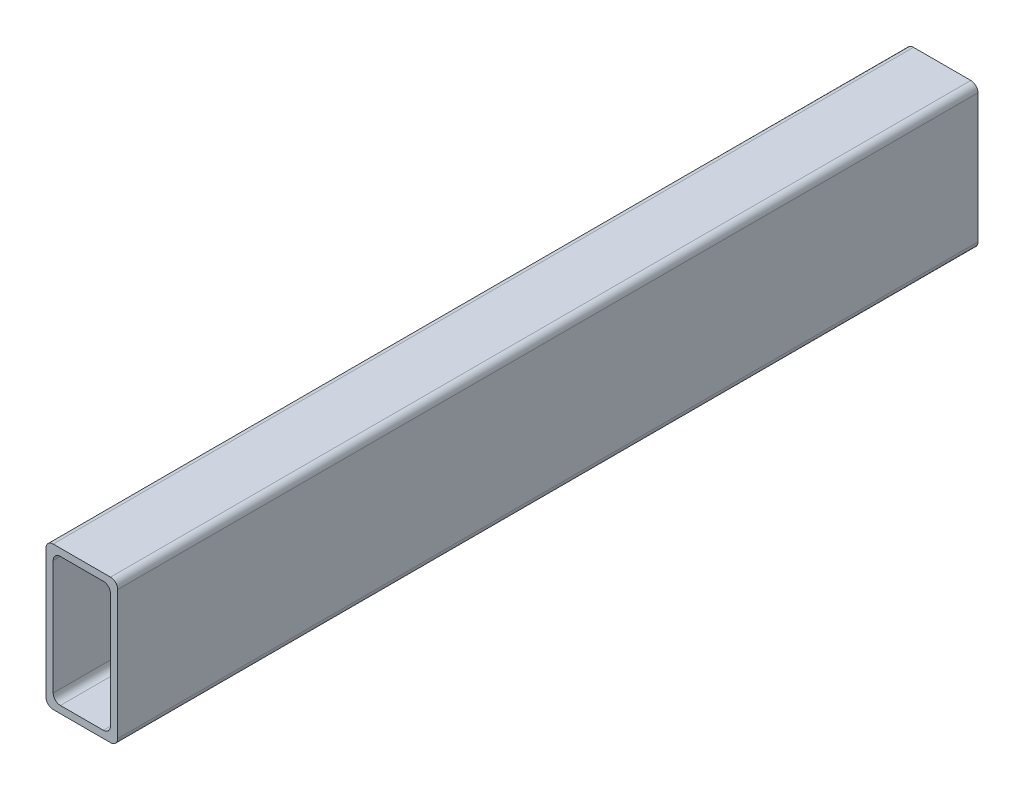
ISO-10303-21;
HEADER;
FILE_DESCRIPTION(('STEP AP214'),'2;1');
FILE_NAME('part.step','',(''),(''),'','','');
FILE_SCHEMA(('AUTOMOTIVE_DESIGN { 1 0 10303 214 1 1 1 1 }'));
ENDSEC;
DATA;
#1=APPLICATION_CONTEXT('core data for automotive mechanical design processes');
#2=APPLICATION_PROTOCOL_DEFINITION('international standard','automotive_design',2000,#1);
#3=PRODUCT_CONTEXT('',#1,'mechanical');
#4=PRODUCT('Part','Part','',(#3));
#5=PRODUCT_RELATED_PRODUCT_CATEGORY('part','',(#4));
#6=PRODUCT_DEFINITION_FORMATION('','',#4);
#7=PRODUCT_DEFINITION_CONTEXT('part definition',#1,'design');
#8=PRODUCT_DEFINITION('design','',#6,#7);
#9=PRODUCT_DEFINITION_SHAPE('','',#8);
#10=(LENGTH_UNIT() NAMED_UNIT(*) SI_UNIT(.MILLI.,.METRE.));
#11=(NAMED_UNIT(*) PLANE_ANGLE_UNIT() SI_UNIT($,.RADIAN.));
#12=(NAMED_UNIT(*) SI_UNIT($,.STERADIAN.) SOLID_ANGLE_UNIT());
#13=UNCERTAINTY_MEASURE_WITH_UNIT(LENGTH_MEASURE(1.E-05),#10,'distance_accuracy_value','');
#14=(GEOMETRIC_REPRESENTATION_CONTEXT(3) GLOBAL_UNCERTAINTY_ASSIGNED_CONTEXT((#13)) GLOBAL_UNIT_ASSIGNED_CONTEXT((#10,
#11,#12)) REPRESENTATION_CONTEXT('',''));
#15=CARTESIAN_POINT('',(0.,0.,0.));
#16=DIRECTION('',(0.,0.,1.));
#17=DIRECTION('',(1.,0.,0.));
#18=AXIS2_PLACEMENT_3D('',#15,#16,#17);
#19=CARTESIAN_POINT('',(-10.0000000000002,47.4999999999999,-300.));
#20=DIRECTION('',(0.,0.,1.));
#21=DIRECTION('',(1.,0.,0.));
#22=AXIS2_PLACEMENT_3D('',#19,#20,#21);
#23=CYLINDRICAL_SURFACE('',#22,2.50000000000006);
#24=CARTESIAN_POINT('',(-10.0000000000002,47.4999999999999,0.));
#25=DIRECTION('',(0.,0.,1.));
#26=DIRECTION('',(1.,0.,0.));
#27=AXIS2_PLACEMENT_3D('',#24,#25,#26);
#28=CIRCLE('',#27,2.50000000000006);
#29=CARTESIAN_POINT('',(-10.0000000000002,50.,0.));
#30=VERTEX_POINT('',#29);
#31=CARTESIAN_POINT('',(-12.5000000000002,47.4999999999999,0.));
#32=VERTEX_POINT('',#31);
#33=EDGE_CURVE('E205',#30,#32,#28,.T.);
#34=ORIENTED_EDGE('',*,*,#33,.F.);
#35=DIRECTION('',(0.,0.,1.));
#36=VECTOR('',#35,1.);
#37=CARTESIAN_POINT('',(-10.0000000000002,50.,-300.));
#38=LINE('',#37,#36);
#39=CARTESIAN_POINT('',(-10.0000000000002,50.,-300.));
#40=VERTEX_POINT('',#39);
#41=EDGE_CURVE('E11',#40,#30,#38,.T.);
#42=ORIENTED_EDGE('',*,*,#41,.F.);
#43=CARTESIAN_POINT('',(-10.0000000000002,47.4999999999999,-300.));
#44=DIRECTION('',(0.,0.,1.));
#45=DIRECTION('',(1.,0.,0.));
#46=AXIS2_PLACEMENT_3D('',#43,#44,#45);
#47=CIRCLE('',#46,2.50000000000006);
#48=CARTESIAN_POINT('',(-12.5000000000002,47.4999999999999,-300.));
#49=VERTEX_POINT('',#48);
#50=EDGE_CURVE('E217',#40,#49,#47,.T.);
#51=ORIENTED_EDGE('',*,*,#50,.T.);
#52=DIRECTION('',(0.,0.,1.));
#53=VECTOR('',#52,1.);
#54=CARTESIAN_POINT('',(-12.5000000000002,47.4999999999999,-300.));
#55=LINE('',#54,#53);
#56=EDGE_CURVE('E38',#49,#32,#55,.T.);
#57=ORIENTED_EDGE('',*,*,#56,.T.);
#58=EDGE_LOOP('',(#34,#42,#51,#57));
#59=FACE_BOUND('',#58,.T.);
#60=ADVANCED_FACE('F35',(#59),#23,.T.);
#61=CARTESIAN_POINT('',(-10.0000000000002,50.,-300.));
#62=DIRECTION('',(0.,1.,0.));
#63=DIRECTION('',(0.,0.,1.));
#64=AXIS2_PLACEMENT_3D('',#61,#62,#63);
#65=PLANE('',#64);
#66=DIRECTION('',(-1.,0.,0.));
#67=VECTOR('',#66,1.);
#68=CARTESIAN_POINT('',(-10.0000000000002,50.,0.));
#69=LINE('',#68,#67);
#70=CARTESIAN_POINT('',(9.99999999999979,50.,0.));
#71=VERTEX_POINT('',#70);
#72=EDGE_CURVE('E221',#71,#30,#69,.T.);
#73=ORIENTED_EDGE('',*,*,#72,.F.);
#74=DIRECTION('',(0.,0.,1.));
#75=VECTOR('',#74,1.);
#76=CARTESIAN_POINT('',(9.99999999999979,50.,-300.));
#77=LINE('',#76,#75);
#78=CARTESIAN_POINT('',(9.99999999999979,50.,-300.));
#79=VERTEX_POINT('',#78);
#80=EDGE_CURVE('E43',#79,#71,#77,.T.);
#81=ORIENTED_EDGE('',*,*,#80,.F.);
#82=DIRECTION('',(-1.,0.,0.));
#83=VECTOR('',#82,1.);
#84=CARTESIAN_POINT('',(-10.0000000000002,50.,-300.));
#85=LINE('',#84,#83);
#86=EDGE_CURVE('E239',#79,#40,#85,.T.);
#87=ORIENTED_EDGE('',*,*,#86,.T.);
#88=ORIENTED_EDGE('',*,*,#41,.T.);
#89=EDGE_LOOP('',(#73,#81,#87,#88));
#90=FACE_BOUND('',#89,.T.);
#91=ADVANCED_FACE('F286',(#90),#65,.T.);
#92=CARTESIAN_POINT('',(9.99999999999934,47.4999999999999,-300.));
#93=DIRECTION('',(0.,0.,1.));
#94=DIRECTION('',(1.,0.,0.));
#95=AXIS2_PLACEMENT_3D('',#92,#93,#94);
#96=CYLINDRICAL_SURFACE('',#95,2.50000000000028);
#97=CARTESIAN_POINT('',(9.99999999999934,47.4999999999999,0.));
#98=DIRECTION('',(0.,0.,1.));
#99=DIRECTION('',(1.,0.,0.));
#100=AXIS2_PLACEMENT_3D('',#97,#98,#99);
#101=CIRCLE('',#100,2.50000000000028);
#102=CARTESIAN_POINT('',(12.4999999999996,47.4999999999999,0.));
#103=VERTEX_POINT('',#102);
#104=EDGE_CURVE('E259',#103,#71,#101,.T.);
#105=ORIENTED_EDGE('',*,*,#104,.F.);
#106=DIRECTION('',(0.,0.,1.));
#107=VECTOR('',#106,1.);
#108=CARTESIAN_POINT('',(12.4999999999996,47.4999999999999,-300.));
#109=LINE('',#108,#107);
#110=CARTESIAN_POINT('',(12.4999999999996,47.4999999999999,-300.));
#111=VERTEX_POINT('',#110);
#112=EDGE_CURVE('E265',#111,#103,#109,.T.);
#113=ORIENTED_EDGE('',*,*,#112,.F.);
#114=CARTESIAN_POINT('',(9.99999999999934,47.4999999999999,-300.));
#115=DIRECTION('',(0.,0.,1.));
#116=DIRECTION('',(1.,0.,0.));
#117=AXIS2_PLACEMENT_3D('',#114,#115,#116);
#118=CIRCLE('',#117,2.50000000000028);
#119=EDGE_CURVE('E236',#111,#79,#118,.T.);
#120=ORIENTED_EDGE('',*,*,#119,.T.);
#121=ORIENTED_EDGE('',*,*,#80,.T.);
#122=EDGE_LOOP('',(#105,#113,#120,#121));
#123=FACE_BOUND('',#122,.T.);
#124=ADVANCED_FACE('F305',(#123),#96,.T.);
#125=CARTESIAN_POINT('',(12.4999999999997,47.4999999999999,-300.));
#126=DIRECTION('',(1.,0.,0.));
#127=DIRECTION('',(0.,0.,-1.));
#128=AXIS2_PLACEMENT_3D('',#125,#126,#127);
#129=PLANE('',#128);
#130=DIRECTION('',(0.,1.,0.));
#131=VECTOR('',#130,1.);
#132=CARTESIAN_POINT('',(12.4999999999997,47.4999999999999,0.));
#133=LINE('',#132,#131);
#134=CARTESIAN_POINT('',(12.4999999999997,2.49999999999995,0.));
#135=VERTEX_POINT('',#134);
#136=EDGE_CURVE('E256',#135,#103,#133,.T.);
#137=ORIENTED_EDGE('',*,*,#136,.F.);
#138=DIRECTION('',(0.,0.,1.));
#139=VECTOR('',#138,1.);
#140=CARTESIAN_POINT('',(12.4999999999997,2.49999999999995,-300.));
#141=LINE('',#140,#139);
#142=CARTESIAN_POINT('',(12.4999999999997,2.49999999999995,-300.));
#143=VERTEX_POINT('',#142);
#144=EDGE_CURVE('E267',#143,#135,#141,.T.);
#145=ORIENTED_EDGE('',*,*,#144,.F.);
#146=DIRECTION('',(0.,1.,0.));
#147=VECTOR('',#146,1.);
#148=CARTESIAN_POINT('',(12.4999999999997,47.4999999999999,-300.));
#149=LINE('',#148,#147);
#150=EDGE_CURVE('E233',#143,#111,#149,.T.);
#151=ORIENTED_EDGE('',*,*,#150,.T.);
#152=ORIENTED_EDGE('',*,*,#112,.T.);
#153=EDGE_LOOP('',(#137,#145,#151,#152));
#154=FACE_BOUND('',#153,.T.);
#155=ADVANCED_FACE('F303',(#154),#129,.T.);
#156=CARTESIAN_POINT('',(9.99999999999934,2.49999999999995,-300.));
#157=DIRECTION('',(0.,0.,1.));
#158=DIRECTION('',(1.,0.,0.));
#159=AXIS2_PLACEMENT_3D('',#156,#157,#158);
#160=CYLINDRICAL_SURFACE('',#159,2.50000000000017);
#161=CARTESIAN_POINT('',(9.99999999999934,2.49999999999995,0.));
#162=DIRECTION('',(0.,0.,1.));
#163=DIRECTION('',(1.,0.,0.));
#164=AXIS2_PLACEMENT_3D('',#161,#162,#163);
#165=CIRCLE('',#164,2.50000000000017);
#166=CARTESIAN_POINT('',(9.99999999999934,-2.22044604925031E-13,0.));
#167=VERTEX_POINT('',#166);
#168=EDGE_CURVE('E253',#167,#135,#165,.T.);
#169=ORIENTED_EDGE('',*,*,#168,.F.);
#170=DIRECTION('',(0.,0.,1.));
#171=VECTOR('',#170,1.);
#172=CARTESIAN_POINT('',(9.99999999999934,-2.22044604925031E-13,-300.));
#173=LINE('',#172,#171);
#174=CARTESIAN_POINT('',(9.99999999999934,-2.22044604925031E-13,-300.));
#175=VERTEX_POINT('',#174);
#176=EDGE_CURVE('E269',#175,#167,#173,.T.);
#177=ORIENTED_EDGE('',*,*,#176,.F.);
#178=CARTESIAN_POINT('',(9.99999999999934,2.49999999999995,-300.));
#179=DIRECTION('',(0.,0.,1.));
#180=DIRECTION('',(1.,0.,0.));
#181=AXIS2_PLACEMENT_3D('',#178,#179,#180);
#182=CIRCLE('',#181,2.50000000000017);
#183=EDGE_CURVE('E230',#175,#143,#182,.T.);
#184=ORIENTED_EDGE('',*,*,#183,.T.);
#185=ORIENTED_EDGE('',*,*,#144,.T.);
#186=EDGE_LOOP('',(#169,#177,#184,#185));
#187=FACE_BOUND('',#186,.T.);
#188=ADVANCED_FACE('F299',(#187),#160,.T.);
#189=CARTESIAN_POINT('',(9.99999999999934,0.,-300.));
#190=DIRECTION('',(0.,-1.,0.));
#191=DIRECTION('',(0.,0.,-1.));
#192=AXIS2_PLACEMENT_3D('',#189,#190,#191);
#193=PLANE('',#192);
#194=DIRECTION('',(1.,0.,0.));
#195=VECTOR('',#194,1.);
#196=CARTESIAN_POINT('',(9.99999999999934,0.,0.));
#197=LINE('',#196,#195);
#198=CARTESIAN_POINT('',(-10.0000000000002,0.,0.));
#199=VERTEX_POINT('',#198);
#200=EDGE_CURVE('E250',#199,#167,#197,.T.);
#201=ORIENTED_EDGE('',*,*,#200,.F.);
#202=DIRECTION('',(0.,0.,1.));
#203=VECTOR('',#202,1.);
#204=CARTESIAN_POINT('',(-10.0000000000002,0.,-300.));
#205=LINE('',#204,#203);
#206=CARTESIAN_POINT('',(-10.0000000000002,0.,-300.));
#207=VERTEX_POINT('',#206);
#208=EDGE_CURVE('E271',#207,#199,#205,.T.);
#209=ORIENTED_EDGE('',*,*,#208,.F.);
#210=DIRECTION('',(1.,0.,0.));
#211=VECTOR('',#210,1.);
#212=CARTESIAN_POINT('',(9.99999999999934,0.,-300.));
#213=LINE('',#212,#211);
#214=EDGE_CURVE('E227',#207,#175,#213,.T.);
#215=ORIENTED_EDGE('',*,*,#214,.T.);
#216=ORIENTED_EDGE('',*,*,#176,.T.);
#217=EDGE_LOOP('',(#201,#209,#215,#216));
#218=FACE_BOUND('',#217,.T.);
#219=ADVANCED_FACE('F297',(#218),#193,.T.);
#220=CARTESIAN_POINT('',(-10.0000000000002,2.49999999999995,-300.));
#221=DIRECTION('',(0.,0.,1.));
#222=DIRECTION('',(1.,0.,0.));
#223=AXIS2_PLACEMENT_3D('',#220,#221,#222);
#224=CYLINDRICAL_SURFACE('',#223,2.49999999999995);
#225=CARTESIAN_POINT('',(-10.0000000000002,2.49999999999995,0.));
#226=DIRECTION('',(0.,0.,1.));
#227=DIRECTION('',(1.,0.,0.));
#228=AXIS2_PLACEMENT_3D('',#225,#226,#227);
#229=CIRCLE('',#228,2.49999999999995);
#230=CARTESIAN_POINT('',(-12.5000000000002,2.49999999999995,0.));
#231=VERTEX_POINT('',#230);
#232=EDGE_CURVE('E247',#231,#199,#229,.T.);
#233=ORIENTED_EDGE('',*,*,#232,.F.);
#234=DIRECTION('',(0.,0.,1.));
#235=VECTOR('',#234,1.);
#236=CARTESIAN_POINT('',(-12.5000000000002,2.49999999999995,-300.));
#237=LINE('',#236,#235);
#238=CARTESIAN_POINT('',(-12.5000000000002,2.49999999999995,-300.));
#239=VERTEX_POINT('',#238);
#240=EDGE_CURVE('E272',#239,#231,#237,.T.);
#241=ORIENTED_EDGE('',*,*,#240,.F.);
#242=CARTESIAN_POINT('',(-10.0000000000002,2.49999999999995,-300.));
#243=DIRECTION('',(0.,0.,1.));
#244=DIRECTION('',(1.,0.,0.));
#245=AXIS2_PLACEMENT_3D('',#242,#243,#244);
#246=CIRCLE('',#245,2.49999999999995);
#247=EDGE_CURVE('E224',#239,#207,#246,.T.);
#248=ORIENTED_EDGE('',*,*,#247,.T.);
#249=ORIENTED_EDGE('',*,*,#208,.T.);
#250=EDGE_LOOP('',(#233,#241,#248,#249));
#251=FACE_BOUND('',#250,.T.);
#252=ADVANCED_FACE('F293',(#251),#224,.T.);
#253=CARTESIAN_POINT('',(-12.5000000000002,2.49999999999995,-300.));
#254=DIRECTION('',(-1.,0.,0.));
#255=DIRECTION('',(0.,0.,1.));
#256=AXIS2_PLACEMENT_3D('',#253,#254,#255);
#257=PLANE('',#256);
#258=DIRECTION('',(0.,-1.,0.));
#259=VECTOR('',#258,1.);
#260=CARTESIAN_POINT('',(-12.5000000000002,2.49999999999995,0.));
#261=LINE('',#260,#259);
#262=EDGE_CURVE('E244',#32,#231,#261,.T.);
#263=ORIENTED_EDGE('',*,*,#262,.F.);
#264=ORIENTED_EDGE('',*,*,#56,.F.);
#265=DIRECTION('',(0.,-1.,0.));
#266=VECTOR('',#265,1.);
#267=CARTESIAN_POINT('',(-12.5000000000002,2.49999999999995,-300.));
#268=LINE('',#267,#266);
#269=EDGE_CURVE('E220',#49,#239,#268,.T.);
#270=ORIENTED_EDGE('',*,*,#269,.T.);
#271=ORIENTED_EDGE('',*,*,#240,.T.);
#272=EDGE_LOOP('',(#263,#264,#270,#271));
#273=FACE_BOUND('',#272,.T.);
#274=ADVANCED_FACE('F280',(#273),#257,.T.);
#275=CARTESIAN_POINT('',(-10.0000000000002,47.4999999999999,-300.));
#276=DIRECTION('',(0.,0.,1.));
#277=DIRECTION('',(1.,0.,0.));
#278=AXIS2_PLACEMENT_3D('',#275,#276,#277);
#279=PLANE('',#278);
#280=DIRECTION('',(-1.,0.,0.));
#281=VECTOR('',#280,1.);
#282=CARTESIAN_POINT('',(-7.50000000000028,47.4999999999999,-300.));
#283=LINE('',#282,#281);
#284=CARTESIAN_POINT('',(7.49999999999984,47.4999999999999,-300.));
#285=VERTEX_POINT('',#284);
#286=CARTESIAN_POINT('',(-7.50000000000028,47.4999999999999,-300.));
#287=VERTEX_POINT('',#286);
#288=EDGE_CURVE('E156',#285,#287,#283,.T.);
#289=ORIENTED_EDGE('',*,*,#288,.T.);
#290=CARTESIAN_POINT('',(-7.49999999999984,44.9999999999999,-300.));
#291=DIRECTION('',(0.,0.,1.));
#292=DIRECTION('',(1.,0.,0.));
#293=AXIS2_PLACEMENT_3D('',#290,#291,#292);
#294=CIRCLE('',#293,2.50000000000017);
#295=CARTESIAN_POINT('',(-10.0000000000002,44.9999999999999,-300.));
#296=VERTEX_POINT('',#295);
#297=EDGE_CURVE('E150',#287,#296,#294,.T.);
#298=ORIENTED_EDGE('',*,*,#297,.T.);
#299=DIRECTION('',(0.,-1.,0.));
#300=VECTOR('',#299,1.);
#301=CARTESIAN_POINT('',(-10.0000000000002,4.99999999999989,-300.));
#302=LINE('',#301,#300);
#303=CARTESIAN_POINT('',(-10.0000000000002,4.99999999999989,-300.));
#304=VERTEX_POINT('',#303);
#305=EDGE_CURVE('E159',#296,#304,#302,.T.);
#306=ORIENTED_EDGE('',*,*,#305,.T.);
#307=CARTESIAN_POINT('',(-7.49999999999984,4.99999999999989,-300.));
#308=DIRECTION('',(0.,0.,1.));
#309=DIRECTION('',(1.,0.,0.));
#310=AXIS2_PLACEMENT_3D('',#307,#308,#309);
#311=CIRCLE('',#310,2.50000000000017);
#312=CARTESIAN_POINT('',(-7.50000000000028,2.49999999999995,-300.));
#313=VERTEX_POINT('',#312);
#314=EDGE_CURVE('E51',#304,#313,#311,.T.);
#315=ORIENTED_EDGE('',*,*,#314,.T.);
#316=DIRECTION('',(1.,0.,0.));
#317=VECTOR('',#316,1.);
#318=CARTESIAN_POINT('',(7.49999999999984,2.49999999999995,-300.));
#319=LINE('',#318,#317);
#320=CARTESIAN_POINT('',(7.49999999999984,2.49999999999995,-300.));
#321=VERTEX_POINT('',#320);
#322=EDGE_CURVE('E174',#313,#321,#319,.T.);
#323=ORIENTED_EDGE('',*,*,#322,.T.);
#324=CARTESIAN_POINT('',(7.49999999999984,4.99999999999989,-300.));
#325=DIRECTION('',(0.,0.,1.));
#326=DIRECTION('',(1.,0.,0.));
#327=AXIS2_PLACEMENT_3D('',#324,#325,#326);
#328=CIRCLE('',#327,2.49999999999995);
#329=CARTESIAN_POINT('',(9.99999999999979,4.99999999999989,-300.));
#330=VERTEX_POINT('',#329);
#331=EDGE_CURVE('E177',#321,#330,#328,.T.);
#332=ORIENTED_EDGE('',*,*,#331,.T.);
#333=DIRECTION('',(0.,1.,0.));
#334=VECTOR('',#333,1.);
#335=CARTESIAN_POINT('',(9.99999999999979,44.9999999999999,-300.));
#336=LINE('',#335,#334);
#337=CARTESIAN_POINT('',(9.99999999999979,44.9999999999999,-300.));
#338=VERTEX_POINT('',#337);
#339=EDGE_CURVE('E180',#330,#338,#336,.T.);
#340=ORIENTED_EDGE('',*,*,#339,.T.);
#341=CARTESIAN_POINT('',(7.49999999999984,44.9999999999999,-300.));
#342=DIRECTION('',(0.,0.,1.));
#343=DIRECTION('',(1.,0.,0.));
#344=AXIS2_PLACEMENT_3D('',#341,#342,#343);
#345=CIRCLE('',#344,2.49999999999995);
#346=EDGE_CURVE('E183',#338,#285,#345,.T.);
#347=ORIENTED_EDGE('',*,*,#346,.T.);
#348=EDGE_LOOP('',(#289,#298,#306,#315,#323,#332,#340,#347));
#349=FACE_BOUND('',#348,.T.);
#350=ORIENTED_EDGE('',*,*,#50,.F.);
#351=ORIENTED_EDGE('',*,*,#86,.F.);
#352=ORIENTED_EDGE('',*,*,#119,.F.);
#353=ORIENTED_EDGE('',*,*,#150,.F.);
#354=ORIENTED_EDGE('',*,*,#183,.F.);
#355=ORIENTED_EDGE('',*,*,#214,.F.);
#356=ORIENTED_EDGE('',*,*,#247,.F.);
#357=ORIENTED_EDGE('',*,*,#269,.F.);
#358=EDGE_LOOP('',(#350,#351,#352,#353,#354,#355,#356,#357));
#359=FACE_BOUND('',#358,.T.);
#360=ADVANCED_FACE('F163',(#349,#359),#279,.F.);
#361=CARTESIAN_POINT('',(-10.0000000000002,47.4999999999999,0.));
#362=DIRECTION('',(0.,0.,1.));
#363=DIRECTION('',(1.,0.,0.));
#364=AXIS2_PLACEMENT_3D('',#361,#362,#363);
#365=PLANE('',#364);
#366=CARTESIAN_POINT('',(-7.49999999999984,44.9999999999999,0.));
#367=DIRECTION('',(0.,0.,1.));
#368=DIRECTION('',(1.,0.,0.));
#369=AXIS2_PLACEMENT_3D('',#366,#367,#368);
#370=CIRCLE('',#369,2.50000000000017);
#371=CARTESIAN_POINT('',(-7.50000000000028,47.4999999999999,0.));
#372=VERTEX_POINT('',#371);
#373=CARTESIAN_POINT('',(-10.0000000000002,44.9999999999999,0.));
#374=VERTEX_POINT('',#373);
#375=EDGE_CURVE('E59',#372,#374,#370,.T.);
#376=ORIENTED_EDGE('',*,*,#375,.F.);
#377=DIRECTION('',(-1.,0.,0.));
#378=VECTOR('',#377,1.);
#379=CARTESIAN_POINT('',(-7.50000000000028,47.4999999999999,0.));
#380=LINE('',#379,#378);
#381=CARTESIAN_POINT('',(7.49999999999984,47.4999999999999,0.));
#382=VERTEX_POINT('',#381);
#383=EDGE_CURVE('E167',#382,#372,#380,.T.);
#384=ORIENTED_EDGE('',*,*,#383,.F.);
#385=CARTESIAN_POINT('',(7.49999999999984,44.9999999999999,0.));
#386=DIRECTION('',(0.,0.,1.));
#387=DIRECTION('',(1.,0.,0.));
#388=AXIS2_PLACEMENT_3D('',#385,#386,#387);
#389=CIRCLE('',#388,2.49999999999995);
#390=CARTESIAN_POINT('',(9.99999999999979,44.9999999999999,0.));
#391=VERTEX_POINT('',#390);
#392=EDGE_CURVE('E170',#391,#382,#389,.T.);
#393=ORIENTED_EDGE('',*,*,#392,.F.);
#394=DIRECTION('',(0.,1.,0.));
#395=VECTOR('',#394,1.);
#396=CARTESIAN_POINT('',(9.99999999999979,44.9999999999999,0.));
#397=LINE('',#396,#395);
#398=CARTESIAN_POINT('',(9.99999999999979,4.99999999999989,0.));
#399=VERTEX_POINT('',#398);
#400=EDGE_CURVE('E198',#399,#391,#397,.T.);
#401=ORIENTED_EDGE('',*,*,#400,.F.);
#402=CARTESIAN_POINT('',(7.49999999999984,4.99999999999989,0.));
#403=DIRECTION('',(0.,0.,1.));
#404=DIRECTION('',(1.,0.,0.));
#405=AXIS2_PLACEMENT_3D('',#402,#403,#404);
#406=CIRCLE('',#405,2.49999999999995);
#407=CARTESIAN_POINT('',(7.49999999999984,2.49999999999995,0.));
#408=VERTEX_POINT('',#407);
#409=EDGE_CURVE('E195',#408,#399,#406,.T.);
#410=ORIENTED_EDGE('',*,*,#409,.F.);
#411=DIRECTION('',(1.,0.,0.));
#412=VECTOR('',#411,1.);
#413=CARTESIAN_POINT('',(7.49999999999984,2.49999999999995,0.));
#414=LINE('',#413,#412);
#415=CARTESIAN_POINT('',(-7.50000000000028,2.49999999999995,0.));
#416=VERTEX_POINT('',#415);
#417=EDGE_CURVE('E192',#416,#408,#414,.T.);
#418=ORIENTED_EDGE('',*,*,#417,.F.);
#419=CARTESIAN_POINT('',(-7.49999999999984,4.99999999999989,0.));
#420=DIRECTION('',(0.,0.,1.));
#421=DIRECTION('',(1.,0.,0.));
#422=AXIS2_PLACEMENT_3D('',#419,#420,#421);
#423=CIRCLE('',#422,2.50000000000017);
#424=CARTESIAN_POINT('',(-10.,4.99999999999989,0.));
#425=VERTEX_POINT('',#424);
#426=EDGE_CURVE('E189',#425,#416,#423,.T.);
#427=ORIENTED_EDGE('',*,*,#426,.F.);
#428=DIRECTION('',(0.,-1.,0.));
#429=VECTOR('',#428,1.);
#430=CARTESIAN_POINT('',(-10.0000000000002,4.99999999999989,0.));
#431=LINE('',#430,#429);
#432=EDGE_CURVE('E187',#374,#425,#431,.T.);
#433=ORIENTED_EDGE('',*,*,#432,.F.);
#434=EDGE_LOOP('',(#376,#384,#393,#401,#410,#418,#427,#433));
#435=FACE_BOUND('',#434,.T.);
#436=ORIENTED_EDGE('',*,*,#33,.T.);
#437=ORIENTED_EDGE('',*,*,#262,.T.);
#438=ORIENTED_EDGE('',*,*,#232,.T.);
#439=ORIENTED_EDGE('',*,*,#200,.T.);
#440=ORIENTED_EDGE('',*,*,#168,.T.);
#441=ORIENTED_EDGE('',*,*,#136,.T.);
#442=ORIENTED_EDGE('',*,*,#104,.T.);
#443=ORIENTED_EDGE('',*,*,#72,.T.);
#444=EDGE_LOOP('',(#436,#437,#438,#439,#440,#441,#442,#443));
#445=FACE_BOUND('',#444,.T.);
#446=ADVANCED_FACE('F282',(#435,#445),#365,.T.);
#447=CARTESIAN_POINT('',(-7.49999999999984,44.9999999999999,-300.));
#448=DIRECTION('',(0.,0.,1.));
#449=DIRECTION('',(1.,0.,0.));
#450=AXIS2_PLACEMENT_3D('',#447,#448,#449);
#451=CYLINDRICAL_SURFACE('',#450,2.50000000000017);
#452=ORIENTED_EDGE('',*,*,#375,.T.);
#453=DIRECTION('',(0.,0.,1.));
#454=VECTOR('',#453,1.);
#455=CARTESIAN_POINT('',(-10.0000000000002,44.9999999999999,-300.));
#456=LINE('',#455,#454);
#457=EDGE_CURVE('E146',#296,#374,#456,.T.);
#458=ORIENTED_EDGE('',*,*,#457,.F.);
#459=ORIENTED_EDGE('',*,*,#297,.F.);
#460=DIRECTION('',(0.,0.,1.));
#461=VECTOR('',#460,1.);
#462=CARTESIAN_POINT('',(-7.50000000000028,47.4999999999999,-300.));
#463=LINE('',#462,#461);
#464=EDGE_CURVE('E203',#287,#372,#463,.T.);
#465=ORIENTED_EDGE('',*,*,#464,.T.);
#466=EDGE_LOOP('',(#452,#458,#459,#465));
#467=FACE_BOUND('',#466,.T.);
#468=ADVANCED_FACE('F148',(#467),#451,.F.);
#469=CARTESIAN_POINT('',(-7.50000000000028,47.4999999999999,-300.));
#470=DIRECTION('',(0.,1.,0.));
#471=DIRECTION('',(0.,0.,1.));
#472=AXIS2_PLACEMENT_3D('',#469,#470,#471);
#473=PLANE('',#472);
#474=ORIENTED_EDGE('',*,*,#383,.T.);
#475=ORIENTED_EDGE('',*,*,#464,.F.);
#476=ORIENTED_EDGE('',*,*,#288,.F.);
#477=DIRECTION('',(0.,0.,1.));
#478=VECTOR('',#477,1.);
#479=CARTESIAN_POINT('',(7.49999999999984,47.4999999999999,-300.));
#480=LINE('',#479,#478);
#481=EDGE_CURVE('E206',#285,#382,#480,.T.);
#482=ORIENTED_EDGE('',*,*,#481,.T.);
#483=EDGE_LOOP('',(#474,#475,#476,#482));
#484=FACE_BOUND('',#483,.T.);
#485=ADVANCED_FACE('F388',(#484),#473,.F.);
#486=CARTESIAN_POINT('',(7.49999999999984,44.9999999999999,-300.));
#487=DIRECTION('',(0.,0.,1.));
#488=DIRECTION('',(1.,0.,0.));
#489=AXIS2_PLACEMENT_3D('',#486,#487,#488);
#490=CYLINDRICAL_SURFACE('',#489,2.49999999999995);
#491=ORIENTED_EDGE('',*,*,#392,.T.);
#492=ORIENTED_EDGE('',*,*,#481,.F.);
#493=ORIENTED_EDGE('',*,*,#346,.F.);
#494=DIRECTION('',(0.,0.,1.));
#495=VECTOR('',#494,1.);
#496=CARTESIAN_POINT('',(9.99999999999979,44.9999999999999,-300.));
#497=LINE('',#496,#495);
#498=EDGE_CURVE('E208',#338,#391,#497,.T.);
#499=ORIENTED_EDGE('',*,*,#498,.T.);
#500=EDGE_LOOP('',(#491,#492,#493,#499));
#501=FACE_BOUND('',#500,.T.);
#502=ADVANCED_FACE('F397',(#501),#490,.F.);
#503=CARTESIAN_POINT('',(9.99999999999979,44.9999999999999,-300.));
#504=DIRECTION('',(1.,0.,0.));
#505=DIRECTION('',(0.,0.,-1.));
#506=AXIS2_PLACEMENT_3D('',#503,#504,#505);
#507=PLANE('',#506);
#508=ORIENTED_EDGE('',*,*,#400,.T.);
#509=ORIENTED_EDGE('',*,*,#498,.F.);
#510=ORIENTED_EDGE('',*,*,#339,.F.);
#511=DIRECTION('',(0.,0.,1.));
#512=VECTOR('',#511,1.);
#513=CARTESIAN_POINT('',(9.99999999999979,4.99999999999989,-300.));
#514=LINE('',#513,#512);
#515=EDGE_CURVE('E210',#330,#399,#514,.T.);
#516=ORIENTED_EDGE('',*,*,#515,.T.);
#517=EDGE_LOOP('',(#508,#509,#510,#516));
#518=FACE_BOUND('',#517,.T.);
#519=ADVANCED_FACE('F407',(#518),#507,.F.);
#520=CARTESIAN_POINT('',(7.49999999999984,4.99999999999989,-300.));
#521=DIRECTION('',(0.,0.,1.));
#522=DIRECTION('',(1.,0.,0.));
#523=AXIS2_PLACEMENT_3D('',#520,#521,#522);
#524=CYLINDRICAL_SURFACE('',#523,2.49999999999995);
#525=ORIENTED_EDGE('',*,*,#409,.T.);
#526=ORIENTED_EDGE('',*,*,#515,.F.);
#527=ORIENTED_EDGE('',*,*,#331,.F.);
#528=DIRECTION('',(0.,0.,1.));
#529=VECTOR('',#528,1.);
#530=CARTESIAN_POINT('',(7.49999999999984,2.49999999999995,-300.));
#531=LINE('',#530,#529);
#532=EDGE_CURVE('E212',#321,#408,#531,.T.);
#533=ORIENTED_EDGE('',*,*,#532,.T.);
#534=EDGE_LOOP('',(#525,#526,#527,#533));
#535=FACE_BOUND('',#534,.T.);
#536=ADVANCED_FACE('F417',(#535),#524,.F.);
#537=CARTESIAN_POINT('',(7.49999999999984,2.49999999999995,-300.));
#538=DIRECTION('',(0.,-1.,0.));
#539=DIRECTION('',(0.,0.,-1.));
#540=AXIS2_PLACEMENT_3D('',#537,#538,#539);
#541=PLANE('',#540);
#542=ORIENTED_EDGE('',*,*,#417,.T.);
#543=ORIENTED_EDGE('',*,*,#532,.F.);
#544=ORIENTED_EDGE('',*,*,#322,.F.);
#545=DIRECTION('',(0.,0.,1.));
#546=VECTOR('',#545,1.);
#547=CARTESIAN_POINT('',(-7.50000000000028,2.49999999999995,-300.));
#548=LINE('',#547,#546);
#549=EDGE_CURVE('E214',#313,#416,#548,.T.);
#550=ORIENTED_EDGE('',*,*,#549,.T.);
#551=EDGE_LOOP('',(#542,#543,#544,#550));
#552=FACE_BOUND('',#551,.T.);
#553=ADVANCED_FACE('F427',(#552),#541,.F.);
#554=CARTESIAN_POINT('',(-7.49999999999984,4.99999999999989,-300.));
#555=DIRECTION('',(0.,0.,1.));
#556=DIRECTION('',(1.,0.,0.));
#557=AXIS2_PLACEMENT_3D('',#554,#555,#556);
#558=CYLINDRICAL_SURFACE('',#557,2.50000000000017);
#559=ORIENTED_EDGE('',*,*,#426,.T.);
#560=ORIENTED_EDGE('',*,*,#549,.F.);
#561=ORIENTED_EDGE('',*,*,#314,.F.);
#562=DIRECTION('',(0.,0.,1.));
#563=VECTOR('',#562,1.);
#564=CARTESIAN_POINT('',(-10.,4.99999999999989,-300.));
#565=LINE('',#564,#563);
#566=EDGE_CURVE('E155',#304,#425,#565,.T.);
#567=ORIENTED_EDGE('',*,*,#566,.T.);
#568=EDGE_LOOP('',(#559,#560,#561,#567));
#569=FACE_BOUND('',#568,.T.);
#570=ADVANCED_FACE('F437',(#569),#558,.F.);
#571=CARTESIAN_POINT('',(-10.0000000000002,4.99999999999989,-300.));
#572=DIRECTION('',(-1.,0.,0.));
#573=DIRECTION('',(0.,0.,1.));
#574=AXIS2_PLACEMENT_3D('',#571,#572,#573);
#575=PLANE('',#574);
#576=ORIENTED_EDGE('',*,*,#432,.T.);
#577=ORIENTED_EDGE('',*,*,#566,.F.);
#578=ORIENTED_EDGE('',*,*,#305,.F.);
#579=ORIENTED_EDGE('',*,*,#457,.T.);
#580=EDGE_LOOP('',(#576,#577,#578,#579));
#581=FACE_BOUND('',#580,.T.);
#582=ADVANCED_FACE('F160',(#581),#575,.F.);
#583=CLOSED_SHELL('',(#60,#91,#124,#155,#188,#219,#252,#274,#360,#446,#468,#485,#502,#519,#536,
#553,#570,#582));
#584=MANIFOLD_SOLID_BREP('B2',#583);
#585=ADVANCED_BREP_SHAPE_REPRESENTATION('',(#18,#584),#14);
#586=SHAPE_DEFINITION_REPRESENTATION(#9,#585);
ENDSEC;
END-ISO-10303-21;
